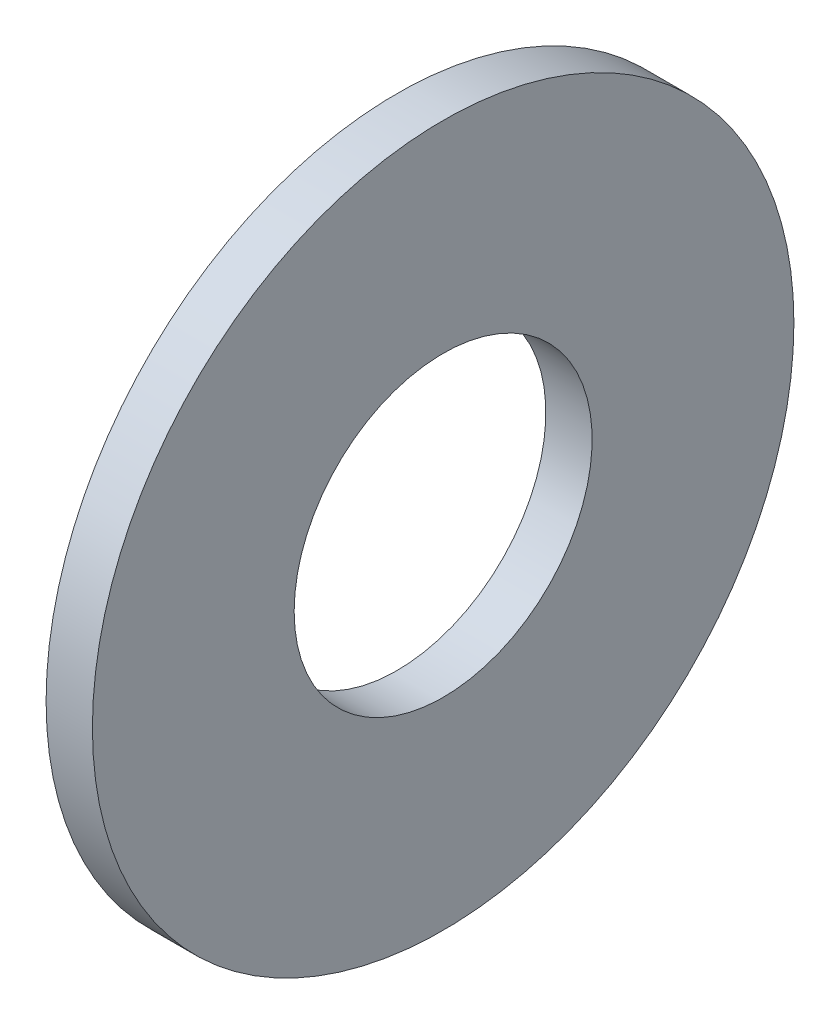
ISO-10303-21;
HEADER;
FILE_DESCRIPTION(('STEP AP214'),'2;1');
FILE_NAME('part.step','',(''),(''),'','','');
FILE_SCHEMA(('AUTOMOTIVE_DESIGN { 1 0 10303 214 1 1 1 1 }'));
ENDSEC;
DATA;
#1=APPLICATION_CONTEXT('core data for automotive mechanical design processes');
#2=APPLICATION_PROTOCOL_DEFINITION('international standard','automotive_design',2000,#1);
#3=PRODUCT_CONTEXT('',#1,'mechanical');
#4=PRODUCT('Part','Part','',(#3));
#5=PRODUCT_RELATED_PRODUCT_CATEGORY('part','',(#4));
#6=PRODUCT_DEFINITION_FORMATION('','',#4);
#7=PRODUCT_DEFINITION_CONTEXT('part definition',#1,'design');
#8=PRODUCT_DEFINITION('design','',#6,#7);
#9=PRODUCT_DEFINITION_SHAPE('','',#8);
#10=(LENGTH_UNIT() NAMED_UNIT(*) SI_UNIT(.MILLI.,.METRE.));
#11=(NAMED_UNIT(*) PLANE_ANGLE_UNIT() SI_UNIT($,.RADIAN.));
#12=(NAMED_UNIT(*) SI_UNIT($,.STERADIAN.) SOLID_ANGLE_UNIT());
#13=UNCERTAINTY_MEASURE_WITH_UNIT(LENGTH_MEASURE(1.E-05),#10,'distance_accuracy_value','');
#14=(GEOMETRIC_REPRESENTATION_CONTEXT(3) GLOBAL_UNCERTAINTY_ASSIGNED_CONTEXT((#13)) GLOBAL_UNIT_ASSIGNED_CONTEXT((#10,
#11,#12)) REPRESENTATION_CONTEXT('',''));
#15=CARTESIAN_POINT('',(0.,0.,0.));
#16=DIRECTION('',(0.,0.,1.));
#17=DIRECTION('',(1.,0.,0.));
#18=AXIS2_PLACEMENT_3D('',#15,#16,#17);
#19=CARTESIAN_POINT('',(-34.925,0.,0.));
#20=DIRECTION('',(-1.,0.,0.));
#21=DIRECTION('',(0.,0.,1.));
#22=AXIS2_PLACEMENT_3D('',#19,#20,#21);
#23=CYLINDRICAL_SURFACE('',#22,13.4874);
#24=CARTESIAN_POINT('',(0.,0.,0.));
#25=DIRECTION('',(-1.,0.,0.));
#26=DIRECTION('',(0.,0.,1.));
#27=AXIS2_PLACEMENT_3D('',#24,#25,#26);
#28=CIRCLE('',#27,13.4874);
#29=CARTESIAN_POINT('',(0.,0.,13.4874));
#30=VERTEX_POINT('',#29);
#31=EDGE_CURVE('E10',#30,#30,#28,.T.);
#32=ORIENTED_EDGE('',*,*,#31,.F.);
#33=EDGE_LOOP('',(#32));
#34=FACE_BOUND('',#33,.T.);
#35=CARTESIAN_POINT('',(-4.191,0.,0.));
#36=DIRECTION('',(-1.,0.,0.));
#37=DIRECTION('',(0.,0.,1.));
#38=AXIS2_PLACEMENT_3D('',#35,#36,#37);
#39=CIRCLE('',#38,13.4874);
#40=CARTESIAN_POINT('',(-4.191,0.,13.4874));
#41=VERTEX_POINT('',#40);
#42=EDGE_CURVE('E29',#41,#41,#39,.T.);
#43=ORIENTED_EDGE('',*,*,#42,.T.);
#44=EDGE_LOOP('',(#43));
#45=FACE_BOUND('',#44,.T.);
#46=ADVANCED_FACE('F15',(#34,#45),#23,.F.);
#47=CARTESIAN_POINT('',(0.,13.4874,0.));
#48=DIRECTION('',(-1.,0.,0.));
#49=DIRECTION('',(0.,0.,1.));
#50=AXIS2_PLACEMENT_3D('',#47,#48,#49);
#51=PLANE('',#50);
#52=CARTESIAN_POINT('',(0.,0.,0.));
#53=DIRECTION('',(-1.,0.,0.));
#54=DIRECTION('',(0.,0.,1.));
#55=AXIS2_PLACEMENT_3D('',#52,#53,#54);
#56=CIRCLE('',#55,31.75);
#57=CARTESIAN_POINT('',(0.,0.,31.75));
#58=VERTEX_POINT('',#57);
#59=EDGE_CURVE('E21',#58,#58,#56,.T.);
#60=ORIENTED_EDGE('',*,*,#59,.F.);
#61=EDGE_LOOP('',(#60));
#62=FACE_BOUND('',#61,.T.);
#63=ORIENTED_EDGE('',*,*,#31,.T.);
#64=EDGE_LOOP('',(#63));
#65=FACE_BOUND('',#64,.T.);
#66=ADVANCED_FACE('F44',(#62,#65),#51,.F.);
#67=CARTESIAN_POINT('',(-34.925,0.,0.));
#68=DIRECTION('',(-1.,0.,0.));
#69=DIRECTION('',(0.,0.,1.));
#70=AXIS2_PLACEMENT_3D('',#67,#68,#69);
#71=CYLINDRICAL_SURFACE('',#70,31.75);
#72=CARTESIAN_POINT('',(-4.191,0.,0.));
#73=DIRECTION('',(-1.,0.,0.));
#74=DIRECTION('',(0.,0.,1.));
#75=AXIS2_PLACEMENT_3D('',#72,#73,#74);
#76=CIRCLE('',#75,31.75);
#77=CARTESIAN_POINT('',(-4.191,0.,31.75));
#78=VERTEX_POINT('',#77);
#79=EDGE_CURVE('E25',#78,#78,#76,.T.);
#80=ORIENTED_EDGE('',*,*,#79,.F.);
#81=EDGE_LOOP('',(#80));
#82=FACE_BOUND('',#81,.T.);
#83=ORIENTED_EDGE('',*,*,#59,.T.);
#84=EDGE_LOOP('',(#83));
#85=FACE_BOUND('',#84,.T.);
#86=ADVANCED_FACE('F39',(#82,#85),#71,.T.);
#87=CARTESIAN_POINT('',(-4.191,31.75,0.));
#88=DIRECTION('',(1.,0.,0.));
#89=DIRECTION('',(0.,0.,-1.));
#90=AXIS2_PLACEMENT_3D('',#87,#88,#89);
#91=PLANE('',#90);
#92=ORIENTED_EDGE('',*,*,#42,.F.);
#93=EDGE_LOOP('',(#92));
#94=FACE_BOUND('',#93,.T.);
#95=ORIENTED_EDGE('',*,*,#79,.T.);
#96=EDGE_LOOP('',(#95));
#97=FACE_BOUND('',#96,.T.);
#98=ADVANCED_FACE('F36',(#94,#97),#91,.F.);
#99=CLOSED_SHELL('',(#46,#66,#86,#98));
#100=MANIFOLD_SOLID_BREP('B1',#99);
#101=ADVANCED_BREP_SHAPE_REPRESENTATION('',(#18,#100),#14);
#102=SHAPE_DEFINITION_REPRESENTATION(#9,#101);
ENDSEC;
END-ISO-10303-21;
